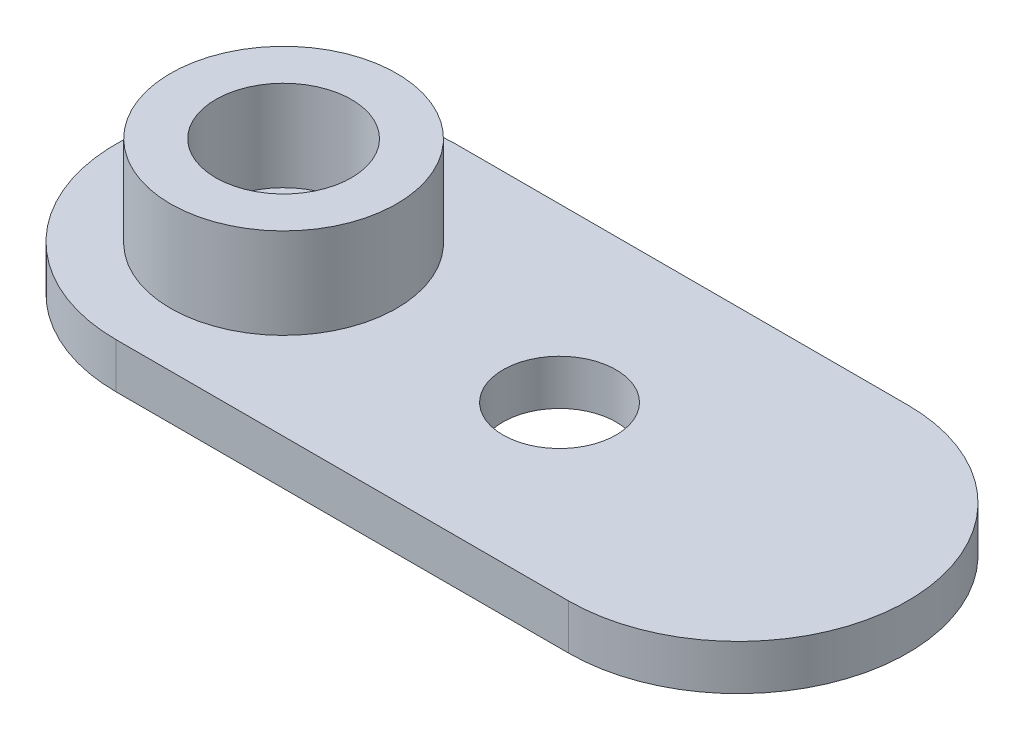
ISO-10303-21;
HEADER;
FILE_DESCRIPTION(('STEP AP214'),'2;1');
FILE_NAME('part.step','',(''),(''),'','','');
FILE_SCHEMA(('AUTOMOTIVE_DESIGN { 1 0 10303 214 1 1 1 1 }'));
ENDSEC;
DATA;
#1=APPLICATION_CONTEXT('core data for automotive mechanical design processes');
#2=APPLICATION_PROTOCOL_DEFINITION('international standard','automotive_design',2000,#1);
#3=PRODUCT_CONTEXT('',#1,'mechanical');
#4=PRODUCT('Part','Part','',(#3));
#5=PRODUCT_RELATED_PRODUCT_CATEGORY('part','',(#4));
#6=PRODUCT_DEFINITION_FORMATION('','',#4);
#7=PRODUCT_DEFINITION_CONTEXT('part definition',#1,'design');
#8=PRODUCT_DEFINITION('design','',#6,#7);
#9=PRODUCT_DEFINITION_SHAPE('','',#8);
#10=(LENGTH_UNIT() NAMED_UNIT(*) SI_UNIT(.MILLI.,.METRE.));
#11=(NAMED_UNIT(*) PLANE_ANGLE_UNIT() SI_UNIT($,.RADIAN.));
#12=(NAMED_UNIT(*) SI_UNIT($,.STERADIAN.) SOLID_ANGLE_UNIT());
#13=UNCERTAINTY_MEASURE_WITH_UNIT(LENGTH_MEASURE(1.E-05),#10,'distance_accuracy_value','');
#14=(GEOMETRIC_REPRESENTATION_CONTEXT(3) GLOBAL_UNCERTAINTY_ASSIGNED_CONTEXT((#13)) GLOBAL_UNIT_ASSIGNED_CONTEXT((#10,
#11,#12)) REPRESENTATION_CONTEXT('',''));
#15=CARTESIAN_POINT('',(0.,0.,0.));
#16=DIRECTION('',(0.,0.,1.));
#17=DIRECTION('',(1.,0.,0.));
#18=AXIS2_PLACEMENT_3D('',#15,#16,#17);
#19=CARTESIAN_POINT('',(0.,2.,-0.0986499226769367));
#20=DIRECTION('',(0.,-1.,0.));
#21=DIRECTION('',(0.,0.,-1.));
#22=AXIS2_PLACEMENT_3D('',#19,#20,#21);
#23=CYLINDRICAL_SURFACE('',#22,7.50000000000001);
#24=CARTESIAN_POINT('',(0.,0.,-0.0986499226769367));
#25=DIRECTION('',(0.,1.,0.));
#26=DIRECTION('',(0.,0.,1.));
#27=AXIS2_PLACEMENT_3D('',#24,#25,#26);
#28=CIRCLE('',#27,7.50000000000001);
#29=CARTESIAN_POINT('',(0.,0.,-7.59864992267694));
#30=VERTEX_POINT('',#29);
#31=CARTESIAN_POINT('',(0.,0.,7.40135007732307));
#32=VERTEX_POINT('',#31);
#33=EDGE_CURVE('E99',#30,#32,#28,.T.);
#34=ORIENTED_EDGE('',*,*,#33,.T.);
#35=DIRECTION('',(0.,-1.,0.));
#36=VECTOR('',#35,1.);
#37=CARTESIAN_POINT('',(0.,2.,7.40135007732307));
#38=LINE('',#37,#36);
#39=CARTESIAN_POINT('',(0.,2.,7.40135007732307));
#40=VERTEX_POINT('',#39);
#41=EDGE_CURVE('E11',#40,#32,#38,.T.);
#42=ORIENTED_EDGE('',*,*,#41,.F.);
#43=CARTESIAN_POINT('',(0.,2.,-0.0986499226769367));
#44=DIRECTION('',(0.,1.,0.));
#45=DIRECTION('',(0.,0.,1.));
#46=AXIS2_PLACEMENT_3D('',#43,#44,#45);
#47=CIRCLE('',#46,7.50000000000001);
#48=CARTESIAN_POINT('',(0.,2.,-7.59864992267694));
#49=VERTEX_POINT('',#48);
#50=EDGE_CURVE('E87',#49,#40,#47,.T.);
#51=ORIENTED_EDGE('',*,*,#50,.F.);
#52=DIRECTION('',(0.,-1.,0.));
#53=VECTOR('',#52,1.);
#54=CARTESIAN_POINT('',(0.,2.,-7.59864992267694));
#55=LINE('',#54,#53);
#56=EDGE_CURVE('E95',#49,#30,#55,.T.);
#57=ORIENTED_EDGE('',*,*,#56,.T.);
#58=EDGE_LOOP('',(#34,#42,#51,#57));
#59=FACE_BOUND('',#58,.T.);
#60=ADVANCED_FACE('F36',(#59),#23,.T.);
#61=CARTESIAN_POINT('',(0.,2.,7.40135007732307));
#62=DIRECTION('',(0.,0.,-1.));
#63=DIRECTION('',(-1.,0.,0.));
#64=AXIS2_PLACEMENT_3D('',#61,#62,#63);
#65=PLANE('',#64);
#66=DIRECTION('',(1.,0.,0.));
#67=VECTOR('',#66,1.);
#68=CARTESIAN_POINT('',(0.,0.,7.40135007732307));
#69=LINE('',#68,#67);
#70=CARTESIAN_POINT('',(20.,0.,7.40135007732305));
#71=VERTEX_POINT('',#70);
#72=EDGE_CURVE('E91',#32,#71,#69,.T.);
#73=ORIENTED_EDGE('',*,*,#72,.T.);
#74=DIRECTION('',(0.,-1.,0.));
#75=VECTOR('',#74,1.);
#76=CARTESIAN_POINT('',(20.,2.,7.40135007732305));
#77=LINE('',#76,#75);
#78=CARTESIAN_POINT('',(20.,2.,7.40135007732305));
#79=VERTEX_POINT('',#78);
#80=EDGE_CURVE('E44',#79,#71,#77,.T.);
#81=ORIENTED_EDGE('',*,*,#80,.F.);
#82=DIRECTION('',(1.,0.,0.));
#83=VECTOR('',#82,1.);
#84=CARTESIAN_POINT('',(0.,2.,7.40135007732307));
#85=LINE('',#84,#83);
#86=EDGE_CURVE('E82',#40,#79,#85,.T.);
#87=ORIENTED_EDGE('',*,*,#86,.F.);
#88=ORIENTED_EDGE('',*,*,#41,.T.);
#89=EDGE_LOOP('',(#73,#81,#87,#88));
#90=FACE_BOUND('',#89,.T.);
#91=ADVANCED_FACE('F90',(#90),#65,.F.);
#92=CARTESIAN_POINT('',(20.,2.,-0.0986499226769379));
#93=DIRECTION('',(0.,-1.,0.));
#94=DIRECTION('',(0.,0.,-1.));
#95=AXIS2_PLACEMENT_3D('',#92,#93,#94);
#96=CYLINDRICAL_SURFACE('',#95,7.49999999999999);
#97=CARTESIAN_POINT('',(20.,0.,-0.0986499226769379));
#98=DIRECTION('',(0.,1.,0.));
#99=DIRECTION('',(0.,0.,1.));
#100=AXIS2_PLACEMENT_3D('',#97,#98,#99);
#101=CIRCLE('',#100,7.49999999999999);
#102=CARTESIAN_POINT('',(20.,0.,-7.59864992267693));
#103=VERTEX_POINT('',#102);
#104=EDGE_CURVE('E69',#71,#103,#101,.T.);
#105=ORIENTED_EDGE('',*,*,#104,.T.);
#106=DIRECTION('',(0.,-1.,0.));
#107=VECTOR('',#106,1.);
#108=CARTESIAN_POINT('',(20.,2.,-7.59864992267693));
#109=LINE('',#108,#107);
#110=CARTESIAN_POINT('',(20.,2.,-7.59864992267693));
#111=VERTEX_POINT('',#110);
#112=EDGE_CURVE('E92',#111,#103,#109,.T.);
#113=ORIENTED_EDGE('',*,*,#112,.F.);
#114=CARTESIAN_POINT('',(20.,2.,-0.0986499226769379));
#115=DIRECTION('',(0.,1.,0.));
#116=DIRECTION('',(0.,0.,1.));
#117=AXIS2_PLACEMENT_3D('',#114,#115,#116);
#118=CIRCLE('',#117,7.49999999999999);
#119=EDGE_CURVE('E85',#79,#111,#118,.T.);
#120=ORIENTED_EDGE('',*,*,#119,.F.);
#121=ORIENTED_EDGE('',*,*,#80,.T.);
#122=EDGE_LOOP('',(#105,#113,#120,#121));
#123=FACE_BOUND('',#122,.T.);
#124=ADVANCED_FACE('F93',(#123),#96,.T.);
#125=CARTESIAN_POINT('',(0.,2.,-7.59864992267694));
#126=DIRECTION('',(0.,0.,1.));
#127=DIRECTION('',(1.,0.,0.));
#128=AXIS2_PLACEMENT_3D('',#125,#126,#127);
#129=PLANE('',#128);
#130=DIRECTION('',(-1.,0.,0.));
#131=VECTOR('',#130,1.);
#132=CARTESIAN_POINT('',(0.,0.,-7.59864992267694));
#133=LINE('',#132,#131);
#134=EDGE_CURVE('E75',#103,#30,#133,.T.);
#135=ORIENTED_EDGE('',*,*,#134,.T.);
#136=ORIENTED_EDGE('',*,*,#56,.F.);
#137=DIRECTION('',(-1.,0.,0.));
#138=VECTOR('',#137,1.);
#139=CARTESIAN_POINT('',(0.,2.,-7.59864992267694));
#140=LINE('',#139,#138);
#141=EDGE_CURVE('E52',#111,#49,#140,.T.);
#142=ORIENTED_EDGE('',*,*,#141,.F.);
#143=ORIENTED_EDGE('',*,*,#112,.T.);
#144=EDGE_LOOP('',(#135,#136,#142,#143));
#145=FACE_BOUND('',#144,.T.);
#146=ADVANCED_FACE('F107',(#145),#129,.F.);
#147=CARTESIAN_POINT('',(0.,2.,-0.0986499226769367));
#148=DIRECTION('',(0.,1.,0.));
#149=DIRECTION('',(0.,0.,1.));
#150=AXIS2_PLACEMENT_3D('',#147,#148,#149);
#151=PLANE('',#150);
#152=CARTESIAN_POINT('',(12.2,2.,0.));
#153=DIRECTION('',(0.,1.,0.));
#154=DIRECTION('',(0.,0.,1.));
#155=AXIS2_PLACEMENT_3D('',#152,#153,#154);
#156=CIRCLE('',#155,2.5);
#157=CARTESIAN_POINT('',(12.2,2.,2.5));
#158=VERTEX_POINT('',#157);
#159=EDGE_CURVE('E131',#158,#158,#156,.T.);
#160=ORIENTED_EDGE('',*,*,#159,.F.);
#161=EDGE_LOOP('',(#160));
#162=FACE_BOUND('',#161,.T.);
#163=CARTESIAN_POINT('',(0.,2.,0.));
#164=DIRECTION('',(0.,1.,0.));
#165=DIRECTION('',(0.,0.,1.));
#166=AXIS2_PLACEMENT_3D('',#163,#164,#165);
#167=CIRCLE('',#166,5.);
#168=CARTESIAN_POINT('',(0.,2.,5.));
#169=VERTEX_POINT('',#168);
#170=EDGE_CURVE('E113',#169,#169,#167,.T.);
#171=ORIENTED_EDGE('',*,*,#170,.F.);
#172=EDGE_LOOP('',(#171));
#173=FACE_BOUND('',#172,.T.);
#174=ORIENTED_EDGE('',*,*,#50,.T.);
#175=ORIENTED_EDGE('',*,*,#86,.T.);
#176=ORIENTED_EDGE('',*,*,#119,.T.);
#177=ORIENTED_EDGE('',*,*,#141,.T.);
#178=EDGE_LOOP('',(#174,#175,#176,#177));
#179=FACE_BOUND('',#178,.T.);
#180=ADVANCED_FACE('F83',(#162,#173,#179),#151,.T.);
#181=CARTESIAN_POINT('',(0.,0.,-0.0986499226769367));
#182=DIRECTION('',(0.,1.,0.));
#183=DIRECTION('',(0.,0.,1.));
#184=AXIS2_PLACEMENT_3D('',#181,#182,#183);
#185=PLANE('',#184);
#186=CARTESIAN_POINT('',(12.2,0.,0.));
#187=DIRECTION('',(0.,1.,0.));
#188=DIRECTION('',(0.,0.,1.));
#189=AXIS2_PLACEMENT_3D('',#186,#187,#188);
#190=CIRCLE('',#189,2.5);
#191=CARTESIAN_POINT('',(12.2,0.,2.5));
#192=VERTEX_POINT('',#191);
#193=EDGE_CURVE('E128',#192,#192,#190,.T.);
#194=ORIENTED_EDGE('',*,*,#193,.T.);
#195=EDGE_LOOP('',(#194));
#196=FACE_BOUND('',#195,.T.);
#197=CARTESIAN_POINT('',(0.,0.,0.));
#198=DIRECTION('',(0.,1.,0.));
#199=DIRECTION('',(0.,0.,1.));
#200=AXIS2_PLACEMENT_3D('',#197,#198,#199);
#201=CIRCLE('',#200,1.5);
#202=CARTESIAN_POINT('',(0.,0.,1.5));
#203=VERTEX_POINT('',#202);
#204=EDGE_CURVE('E124',#203,#203,#201,.T.);
#205=ORIENTED_EDGE('',*,*,#204,.T.);
#206=EDGE_LOOP('',(#205));
#207=FACE_BOUND('',#206,.T.);
#208=ORIENTED_EDGE('',*,*,#33,.F.);
#209=ORIENTED_EDGE('',*,*,#134,.F.);
#210=ORIENTED_EDGE('',*,*,#104,.F.);
#211=ORIENTED_EDGE('',*,*,#72,.F.);
#212=EDGE_LOOP('',(#208,#209,#210,#211));
#213=FACE_BOUND('',#212,.T.);
#214=ADVANCED_FACE('F110',(#196,#207,#213),#185,.F.);
#215=CARTESIAN_POINT('',(0.,6.,0.));
#216=DIRECTION('',(0.,-1.,0.));
#217=DIRECTION('',(0.,0.,-1.));
#218=AXIS2_PLACEMENT_3D('',#215,#216,#217);
#219=CYLINDRICAL_SURFACE('',#218,5.);
#220=CARTESIAN_POINT('',(0.,6.,0.));
#221=DIRECTION('',(0.,1.,0.));
#222=DIRECTION('',(0.,0.,1.));
#223=AXIS2_PLACEMENT_3D('',#220,#221,#222);
#224=CIRCLE('',#223,5.);
#225=CARTESIAN_POINT('',(0.,6.,5.));
#226=VERTEX_POINT('',#225);
#227=EDGE_CURVE('E102',#226,#226,#224,.T.);
#228=ORIENTED_EDGE('',*,*,#227,.F.);
#229=EDGE_LOOP('',(#228));
#230=FACE_BOUND('',#229,.T.);
#231=ORIENTED_EDGE('',*,*,#170,.T.);
#232=EDGE_LOOP('',(#231));
#233=FACE_BOUND('',#232,.T.);
#234=ADVANCED_FACE('F151',(#230,#233),#219,.T.);
#235=CARTESIAN_POINT('',(0.,6.,0.));
#236=DIRECTION('',(0.,1.,0.));
#237=DIRECTION('',(0.,0.,1.));
#238=AXIS2_PLACEMENT_3D('',#235,#236,#237);
#239=PLANE('',#238);
#240=CARTESIAN_POINT('',(0.,6.,0.));
#241=DIRECTION('',(0.,1.,0.));
#242=DIRECTION('',(0.,0.,1.));
#243=AXIS2_PLACEMENT_3D('',#240,#241,#242);
#244=CIRCLE('',#243,3.);
#245=CARTESIAN_POINT('',(0.,6.,3.));
#246=VERTEX_POINT('',#245);
#247=EDGE_CURVE('E121',#246,#246,#244,.T.);
#248=ORIENTED_EDGE('',*,*,#247,.F.);
#249=EDGE_LOOP('',(#248));
#250=FACE_BOUND('',#249,.T.);
#251=ORIENTED_EDGE('',*,*,#227,.T.);
#252=EDGE_LOOP('',(#251));
#253=FACE_BOUND('',#252,.T.);
#254=ADVANCED_FACE('F153',(#250,#253),#239,.T.);
#255=CARTESIAN_POINT('',(0.,-6.48528137423857,0.));
#256=DIRECTION('',(0.,1.,0.));
#257=DIRECTION('',(0.,0.,1.));
#258=AXIS2_PLACEMENT_3D('',#255,#256,#257);
#259=CYLINDRICAL_SURFACE('',#258,3.);
#260=CARTESIAN_POINT('',(0.,2.,0.));
#261=DIRECTION('',(0.,1.,0.));
#262=DIRECTION('',(0.,0.,1.));
#263=AXIS2_PLACEMENT_3D('',#260,#261,#262);
#264=CIRCLE('',#263,3.);
#265=CARTESIAN_POINT('',(0.,2.,3.));
#266=VERTEX_POINT('',#265);
#267=EDGE_CURVE('E116',#266,#266,#264,.F.);
#268=ORIENTED_EDGE('',*,*,#267,.T.);
#269=EDGE_LOOP('',(#268));
#270=FACE_BOUND('',#269,.T.);
#271=ORIENTED_EDGE('',*,*,#247,.T.);
#272=EDGE_LOOP('',(#271));
#273=FACE_BOUND('',#272,.T.);
#274=ADVANCED_FACE('F160',(#270,#273),#259,.F.);
#275=CARTESIAN_POINT('',(0.,2.,-0.0986499226769367));
#276=DIRECTION('',(0.,1.,0.));
#277=DIRECTION('',(0.,0.,1.));
#278=AXIS2_PLACEMENT_3D('',#275,#276,#277);
#279=PLANE('',#278);
#280=CARTESIAN_POINT('',(0.,2.,0.));
#281=DIRECTION('',(0.,1.,0.));
#282=DIRECTION('',(0.,0.,1.));
#283=AXIS2_PLACEMENT_3D('',#280,#281,#282);
#284=CIRCLE('',#283,1.5);
#285=CARTESIAN_POINT('',(0.,2.,1.5));
#286=VERTEX_POINT('',#285);
#287=EDGE_CURVE('E125',#286,#286,#284,.T.);
#288=ORIENTED_EDGE('',*,*,#287,.F.);
#289=EDGE_LOOP('',(#288));
#290=FACE_BOUND('',#289,.T.);
#291=ORIENTED_EDGE('',*,*,#267,.F.);
#292=EDGE_LOOP('',(#291));
#293=FACE_BOUND('',#292,.T.);
#294=ADVANCED_FACE('F203',(#290,#293),#279,.T.);
#295=CARTESIAN_POINT('',(0.,0.,0.));
#296=DIRECTION('',(0.,1.,0.));
#297=DIRECTION('',(0.,0.,1.));
#298=AXIS2_PLACEMENT_3D('',#295,#296,#297);
#299=CYLINDRICAL_SURFACE('',#298,1.5);
#300=ORIENTED_EDGE('',*,*,#204,.F.);
#301=EDGE_LOOP('',(#300));
#302=FACE_BOUND('',#301,.T.);
#303=ORIENTED_EDGE('',*,*,#287,.T.);
#304=EDGE_LOOP('',(#303));
#305=FACE_BOUND('',#304,.T.);
#306=ADVANCED_FACE('F142',(#302,#305),#299,.F.);
#307=CARTESIAN_POINT('',(12.2,0.,0.));
#308=DIRECTION('',(0.,1.,0.));
#309=DIRECTION('',(0.,0.,1.));
#310=AXIS2_PLACEMENT_3D('',#307,#308,#309);
#311=CYLINDRICAL_SURFACE('',#310,2.5);
#312=ORIENTED_EDGE('',*,*,#193,.F.);
#313=EDGE_LOOP('',(#312));
#314=FACE_BOUND('',#313,.T.);
#315=ORIENTED_EDGE('',*,*,#159,.T.);
#316=EDGE_LOOP('',(#315));
#317=FACE_BOUND('',#316,.T.);
#318=ADVANCED_FACE('F139',(#314,#317),#311,.F.);
#319=CLOSED_SHELL('',(#60,#91,#124,#146,#180,#214,#234,#254,#274,#294,#306,#318));
#320=MANIFOLD_SOLID_BREP('B2',#319);
#321=ADVANCED_BREP_SHAPE_REPRESENTATION('',(#18,#320),#14);
#322=SHAPE_DEFINITION_REPRESENTATION(#9,#321);
ENDSEC;
END-ISO-10303-21;
